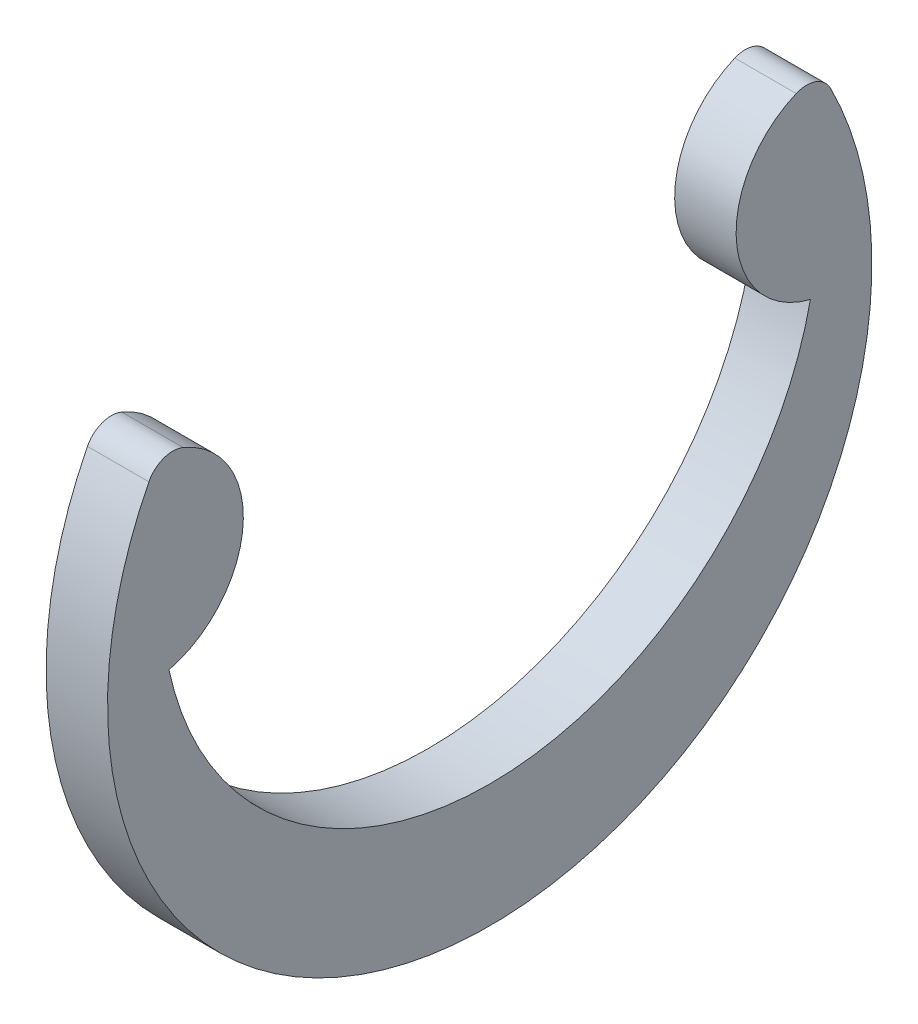
ISO-10303-21;
HEADER;
FILE_DESCRIPTION(('STEP AP214'),'2;1');
FILE_NAME('part.step','',(''),(''),'','','');
FILE_SCHEMA(('AUTOMOTIVE_DESIGN { 1 0 10303 214 1 1 1 1 }'));
ENDSEC;
DATA;
#1=APPLICATION_CONTEXT('core data for automotive mechanical design processes');
#2=APPLICATION_PROTOCOL_DEFINITION('international standard','automotive_design',2000,#1);
#3=PRODUCT_CONTEXT('',#1,'mechanical');
#4=PRODUCT('Part','Part','',(#3));
#5=PRODUCT_RELATED_PRODUCT_CATEGORY('part','',(#4));
#6=PRODUCT_DEFINITION_FORMATION('','',#4);
#7=PRODUCT_DEFINITION_CONTEXT('part definition',#1,'design');
#8=PRODUCT_DEFINITION('design','',#6,#7);
#9=PRODUCT_DEFINITION_SHAPE('','',#8);
#10=(LENGTH_UNIT() NAMED_UNIT(*) SI_UNIT(.MILLI.,.METRE.));
#11=(NAMED_UNIT(*) PLANE_ANGLE_UNIT() SI_UNIT($,.RADIAN.));
#12=(NAMED_UNIT(*) SI_UNIT($,.STERADIAN.) SOLID_ANGLE_UNIT());
#13=UNCERTAINTY_MEASURE_WITH_UNIT(LENGTH_MEASURE(1.E-05),#10,'distance_accuracy_value','');
#14=(GEOMETRIC_REPRESENTATION_CONTEXT(3) GLOBAL_UNCERTAINTY_ASSIGNED_CONTEXT((#13)) GLOBAL_UNIT_ASSIGNED_CONTEXT((#10,
#11,#12)) REPRESENTATION_CONTEXT('',''));
#15=CARTESIAN_POINT('',(0.,0.,0.));
#16=DIRECTION('',(0.,0.,1.));
#17=DIRECTION('',(1.,0.,0.));
#18=AXIS2_PLACEMENT_3D('',#15,#16,#17);
#19=CARTESIAN_POINT('',(0.3175,0.982787689221727,3.55926968931105));
#20=DIRECTION('',(-1.,0.,0.));
#21=DIRECTION('',(0.,0.,1.));
#22=AXIS2_PLACEMENT_3D('',#19,#20,#21);
#23=CYLINDRICAL_SURFACE('',#22,1.01276155881603);
#24=CARTESIAN_POINT('',(-0.3175,0.982787689221727,3.55926968931105));
#25=DIRECTION('',(1.,0.,0.));
#26=DIRECTION('',(0.,0.,1.));
#27=AXIS2_PLACEMENT_3D('',#24,#25,#26);
#28=CIRCLE('',#27,1.01276155881603);
#29=CARTESIAN_POINT('',(-0.3175,0.,3.3147));
#30=VERTEX_POINT('',#29);
#31=CARTESIAN_POINT('',(-0.3175,1.91687954310492,3.16791513967025));
#32=VERTEX_POINT('',#31);
#33=EDGE_CURVE('E118',#30,#32,#28,.T.);
#34=ORIENTED_EDGE('',*,*,#33,.T.);
#35=DIRECTION('',(-1.,0.,0.));
#36=VECTOR('',#35,1.);
#37=CARTESIAN_POINT('',(0.3175,1.91687954310492,3.16791513967025));
#38=LINE('',#37,#36);
#39=CARTESIAN_POINT('',(0.3175,1.91687954310492,3.16791513967025));
#40=VERTEX_POINT('',#39);
#41=EDGE_CURVE('E11',#40,#32,#38,.T.);
#42=ORIENTED_EDGE('',*,*,#41,.F.);
#43=CARTESIAN_POINT('',(0.3175,0.982787689221727,3.55926968931105));
#44=DIRECTION('',(1.,0.,0.));
#45=DIRECTION('',(0.,0.,1.));
#46=AXIS2_PLACEMENT_3D('',#43,#44,#45);
#47=CIRCLE('',#46,1.01276155881603);
#48=CARTESIAN_POINT('',(0.3175,0.,3.3147));
#49=VERTEX_POINT('',#48);
#50=EDGE_CURVE('E128',#49,#40,#47,.T.);
#51=ORIENTED_EDGE('',*,*,#50,.F.);
#52=DIRECTION('',(-1.,0.,0.));
#53=VECTOR('',#52,1.);
#54=CARTESIAN_POINT('',(0.3175,0.,3.3147));
#55=LINE('',#54,#53);
#56=EDGE_CURVE('E114',#49,#30,#55,.T.);
#57=ORIENTED_EDGE('',*,*,#56,.T.);
#58=EDGE_LOOP('',(#34,#42,#51,#57));
#59=FACE_BOUND('',#58,.T.);
#60=ADVANCED_FACE('F34',(#59),#23,.T.);
#61=CARTESIAN_POINT('',(0.3175,1.66096845654136,3.27513368312914));
#62=DIRECTION('',(-1.,0.,0.));
#63=DIRECTION('',(0.,0.,1.));
#64=AXIS2_PLACEMENT_3D('',#61,#62,#63);
#65=CYLINDRICAL_SURFACE('',#64,0.277464052243861);
#66=CARTESIAN_POINT('',(-0.3175,1.66096845654136,3.27513368312914));
#67=DIRECTION('',(1.,0.,0.));
#68=DIRECTION('',(0.,0.,1.));
#69=AXIS2_PLACEMENT_3D('',#66,#67,#68);
#70=CIRCLE('',#69,0.277464052243861);
#71=CARTESIAN_POINT('',(-0.3175,1.78646666666667,3.52259377999918));
#72=VERTEX_POINT('',#71);
#73=EDGE_CURVE('E121',#32,#72,#70,.T.);
#74=ORIENTED_EDGE('',*,*,#73,.T.);
#75=DIRECTION('',(-1.,0.,0.));
#76=VECTOR('',#75,1.);
#77=CARTESIAN_POINT('',(0.3175,1.78646666666667,3.52259377999918));
#78=LINE('',#77,#76);
#79=CARTESIAN_POINT('',(0.3175,1.78646666666667,3.52259377999918));
#80=VERTEX_POINT('',#79);
#81=EDGE_CURVE('E42',#80,#72,#78,.T.);
#82=ORIENTED_EDGE('',*,*,#81,.F.);
#83=CARTESIAN_POINT('',(0.3175,1.66096845654136,3.27513368312914));
#84=DIRECTION('',(1.,0.,0.));
#85=DIRECTION('',(0.,0.,1.));
#86=AXIS2_PLACEMENT_3D('',#83,#84,#85);
#87=CIRCLE('',#86,0.277464052243861);
#88=EDGE_CURVE('E87',#40,#80,#87,.T.);
#89=ORIENTED_EDGE('',*,*,#88,.F.);
#90=ORIENTED_EDGE('',*,*,#41,.T.);
#91=EDGE_LOOP('',(#74,#82,#89,#90));
#92=FACE_BOUND('',#91,.T.);
#93=ADVANCED_FACE('F152',(#92),#65,.T.);
#94=CARTESIAN_POINT('',(0.3175,0.,0.));
#95=DIRECTION('',(-1.,0.,0.));
#96=DIRECTION('',(0.,0.,1.));
#97=AXIS2_PLACEMENT_3D('',#94,#95,#96);
#98=CYLINDRICAL_SURFACE('',#97,3.9497);
#99=CARTESIAN_POINT('',(-0.3175,0.,0.));
#100=DIRECTION('',(1.,0.,0.));
#101=DIRECTION('',(0.,0.,1.));
#102=AXIS2_PLACEMENT_3D('',#99,#100,#101);
#103=CIRCLE('',#102,3.9497);
#104=CARTESIAN_POINT('',(-0.3175,1.78646666666667,-3.52259377999918));
#105=VERTEX_POINT('',#104);
#106=EDGE_CURVE('E123',#72,#105,#103,.T.);
#107=ORIENTED_EDGE('',*,*,#106,.T.);
#108=DIRECTION('',(-1.,0.,0.));
#109=VECTOR('',#108,1.);
#110=CARTESIAN_POINT('',(0.3175,1.78646666666667,-3.52259377999918));
#111=LINE('',#110,#109);
#112=CARTESIAN_POINT('',(0.3175,1.78646666666667,-3.52259377999918));
#113=VERTEX_POINT('',#112);
#114=EDGE_CURVE('E109',#113,#105,#111,.T.);
#115=ORIENTED_EDGE('',*,*,#114,.F.);
#116=CARTESIAN_POINT('',(0.3175,0.,0.));
#117=DIRECTION('',(1.,0.,0.));
#118=DIRECTION('',(0.,0.,1.));
#119=AXIS2_PLACEMENT_3D('',#116,#117,#118);
#120=CIRCLE('',#119,3.9497);
#121=EDGE_CURVE('E100',#80,#113,#120,.T.);
#122=ORIENTED_EDGE('',*,*,#121,.F.);
#123=ORIENTED_EDGE('',*,*,#81,.T.);
#124=EDGE_LOOP('',(#107,#115,#122,#123));
#125=FACE_BOUND('',#124,.T.);
#126=ADVANCED_FACE('F134',(#125),#98,.T.);
#127=CARTESIAN_POINT('',(0.3175,1.66096845654136,-3.27513368312914));
#128=DIRECTION('',(-1.,0.,0.));
#129=DIRECTION('',(0.,0.,1.));
#130=AXIS2_PLACEMENT_3D('',#127,#128,#129);
#131=CYLINDRICAL_SURFACE('',#130,0.277464052243861);
#132=CARTESIAN_POINT('',(-0.3175,1.66096845654136,-3.27513368312914));
#133=DIRECTION('',(1.,0.,0.));
#134=DIRECTION('',(0.,0.,-1.));
#135=AXIS2_PLACEMENT_3D('',#132,#133,#134);
#136=CIRCLE('',#135,0.277464052243861);
#137=CARTESIAN_POINT('',(-0.3175,1.91687954310492,-3.16791513967025));
#138=VERTEX_POINT('',#137);
#139=EDGE_CURVE('E108',#105,#138,#136,.T.);
#140=ORIENTED_EDGE('',*,*,#139,.T.);
#141=DIRECTION('',(-1.,0.,0.));
#142=VECTOR('',#141,1.);
#143=CARTESIAN_POINT('',(0.3175,1.91687954310492,-3.16791513967025));
#144=LINE('',#143,#142);
#145=CARTESIAN_POINT('',(0.3175,1.91687954310492,-3.16791513967025));
#146=VERTEX_POINT('',#145);
#147=EDGE_CURVE('E105',#146,#138,#144,.T.);
#148=ORIENTED_EDGE('',*,*,#147,.F.);
#149=CARTESIAN_POINT('',(0.3175,1.66096845654136,-3.27513368312914));
#150=DIRECTION('',(1.,0.,0.));
#151=DIRECTION('',(0.,0.,-1.));
#152=AXIS2_PLACEMENT_3D('',#149,#150,#151);
#153=CIRCLE('',#152,0.277464052243861);
#154=EDGE_CURVE('E94',#113,#146,#153,.T.);
#155=ORIENTED_EDGE('',*,*,#154,.F.);
#156=ORIENTED_EDGE('',*,*,#114,.T.);
#157=EDGE_LOOP('',(#140,#148,#155,#156));
#158=FACE_BOUND('',#157,.T.);
#159=ADVANCED_FACE('F106',(#158),#131,.T.);
#160=CARTESIAN_POINT('',(0.3175,0.982787689221727,-3.55926968931105));
#161=DIRECTION('',(-1.,0.,0.));
#162=DIRECTION('',(0.,0.,1.));
#163=AXIS2_PLACEMENT_3D('',#160,#161,#162);
#164=CYLINDRICAL_SURFACE('',#163,1.01276155881603);
#165=CARTESIAN_POINT('',(-0.3175,0.982787689221727,-3.55926968931105));
#166=DIRECTION('',(1.,0.,0.));
#167=DIRECTION('',(0.,0.,1.));
#168=AXIS2_PLACEMENT_3D('',#165,#166,#167);
#169=CIRCLE('',#168,1.01276155881603);
#170=CARTESIAN_POINT('',(-0.3175,0.,-3.3147));
#171=VERTEX_POINT('',#170);
#172=EDGE_CURVE('E73',#138,#171,#169,.T.);
#173=ORIENTED_EDGE('',*,*,#172,.T.);
#174=DIRECTION('',(-1.,0.,0.));
#175=VECTOR('',#174,1.);
#176=CARTESIAN_POINT('',(0.3175,0.,-3.3147));
#177=LINE('',#176,#175);
#178=CARTESIAN_POINT('',(0.3175,0.,-3.3147));
#179=VERTEX_POINT('',#178);
#180=EDGE_CURVE('E110',#179,#171,#177,.T.);
#181=ORIENTED_EDGE('',*,*,#180,.F.);
#182=CARTESIAN_POINT('',(0.3175,0.982787689221727,-3.55926968931105));
#183=DIRECTION('',(1.,0.,0.));
#184=DIRECTION('',(0.,0.,1.));
#185=AXIS2_PLACEMENT_3D('',#182,#183,#184);
#186=CIRCLE('',#185,1.01276155881603);
#187=EDGE_CURVE('E98',#146,#179,#186,.T.);
#188=ORIENTED_EDGE('',*,*,#187,.F.);
#189=ORIENTED_EDGE('',*,*,#147,.T.);
#190=EDGE_LOOP('',(#173,#181,#188,#189));
#191=FACE_BOUND('',#190,.T.);
#192=ADVANCED_FACE('F112',(#191),#164,.T.);
#193=CARTESIAN_POINT('',(0.3175,0.710236966824645,0.));
#194=DIRECTION('',(-1.,0.,0.));
#195=DIRECTION('',(0.,0.,1.));
#196=AXIS2_PLACEMENT_3D('',#193,#194,#195);
#197=CYLINDRICAL_SURFACE('',#196,3.38993696682464);
#198=CARTESIAN_POINT('',(-0.3175,0.710236966824645,0.));
#199=DIRECTION('',(-1.,0.,0.));
#200=DIRECTION('',(0.,0.,-1.));
#201=AXIS2_PLACEMENT_3D('',#198,#199,#200);
#202=CIRCLE('',#201,3.38993696682464);
#203=EDGE_CURVE('E79',#171,#30,#202,.T.);
#204=ORIENTED_EDGE('',*,*,#203,.T.);
#205=ORIENTED_EDGE('',*,*,#56,.F.);
#206=CARTESIAN_POINT('',(0.3175,0.710236966824645,0.));
#207=DIRECTION('',(-1.,0.,0.));
#208=DIRECTION('',(0.,0.,-1.));
#209=AXIS2_PLACEMENT_3D('',#206,#207,#208);
#210=CIRCLE('',#209,3.38993696682464);
#211=EDGE_CURVE('E50',#179,#49,#210,.T.);
#212=ORIENTED_EDGE('',*,*,#211,.F.);
#213=ORIENTED_EDGE('',*,*,#180,.T.);
#214=EDGE_LOOP('',(#204,#205,#212,#213));
#215=FACE_BOUND('',#214,.T.);
#216=ADVANCED_FACE('F141',(#215),#197,.F.);
#217=CARTESIAN_POINT('',(0.3175,0.846512328023186,1.77963484465552));
#218=DIRECTION('',(-1.,0.,0.));
#219=DIRECTION('',(0.,0.,1.));
#220=AXIS2_PLACEMENT_3D('',#217,#218,#219);
#221=PLANE('',#220);
#222=ORIENTED_EDGE('',*,*,#50,.T.);
#223=ORIENTED_EDGE('',*,*,#88,.T.);
#224=ORIENTED_EDGE('',*,*,#121,.T.);
#225=ORIENTED_EDGE('',*,*,#154,.T.);
#226=ORIENTED_EDGE('',*,*,#187,.T.);
#227=ORIENTED_EDGE('',*,*,#211,.T.);
#228=EDGE_LOOP('',(#222,#223,#224,#225,#226,#227));
#229=FACE_BOUND('',#228,.T.);
#230=ADVANCED_FACE('F96',(#229),#221,.F.);
#231=CARTESIAN_POINT('',(-0.3175,0.846512328023186,1.77963484465552));
#232=DIRECTION('',(-1.,0.,0.));
#233=DIRECTION('',(0.,0.,1.));
#234=AXIS2_PLACEMENT_3D('',#231,#232,#233);
#235=PLANE('',#234);
#236=ORIENTED_EDGE('',*,*,#33,.F.);
#237=ORIENTED_EDGE('',*,*,#203,.F.);
#238=ORIENTED_EDGE('',*,*,#172,.F.);
#239=ORIENTED_EDGE('',*,*,#139,.F.);
#240=ORIENTED_EDGE('',*,*,#106,.F.);
#241=ORIENTED_EDGE('',*,*,#73,.F.);
#242=EDGE_LOOP('',(#236,#237,#238,#239,#240,#241));
#243=FACE_BOUND('',#242,.T.);
#244=ADVANCED_FACE('F137',(#243),#235,.T.);
#245=CLOSED_SHELL('',(#60,#93,#126,#159,#192,#216,#230,#244));
#246=MANIFOLD_SOLID_BREP('B2',#245);
#247=ADVANCED_BREP_SHAPE_REPRESENTATION('',(#18,#246),#14);
#248=SHAPE_DEFINITION_REPRESENTATION(#9,#247);
ENDSEC;
END-ISO-10303-21;
